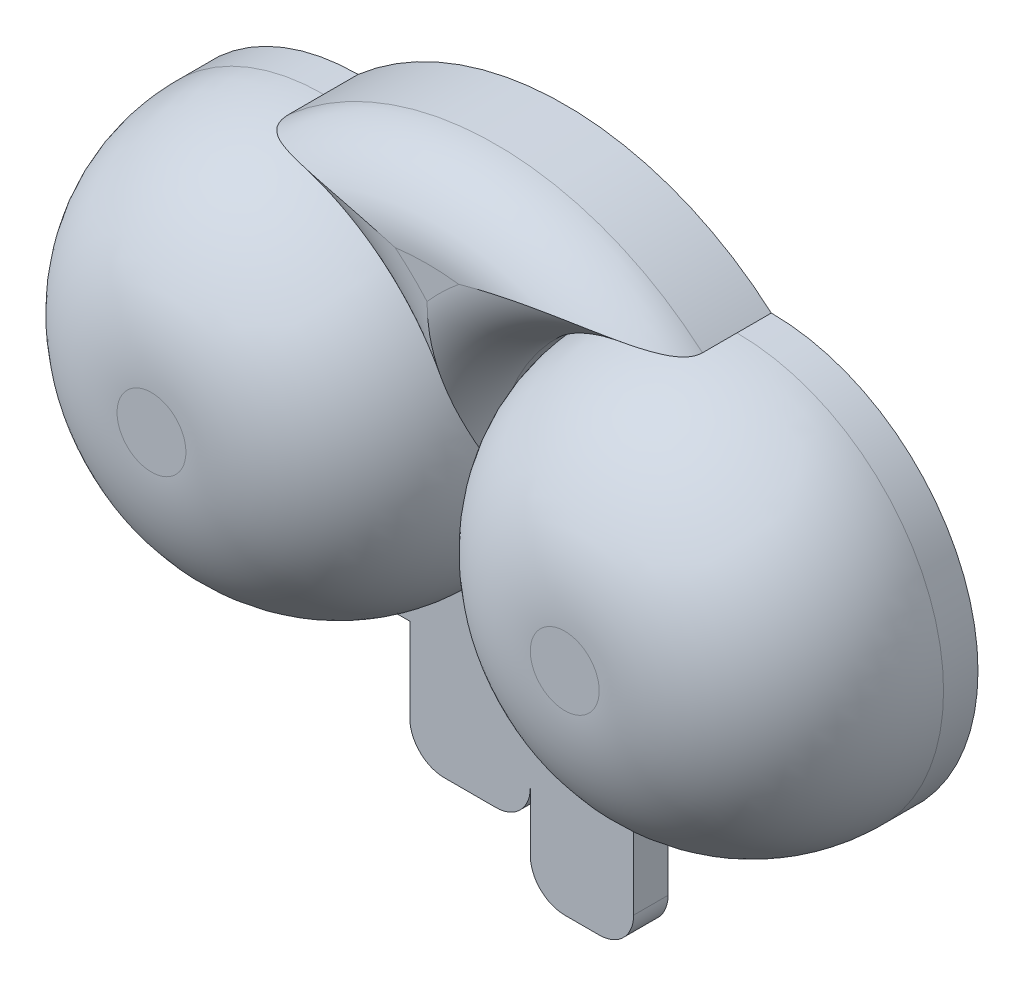
ISO-10303-21;
HEADER;
FILE_DESCRIPTION(('STEP AP214'),'2;1');
FILE_NAME('part.step','',(''),(''),'','','');
FILE_SCHEMA(('AUTOMOTIVE_DESIGN { 1 0 10303 214 1 1 1 1 }'));
ENDSEC;
DATA;
#1=APPLICATION_CONTEXT('core data for automotive mechanical design processes');
#2=APPLICATION_PROTOCOL_DEFINITION('international standard','automotive_design',2000,#1);
#3=PRODUCT_CONTEXT('',#1,'mechanical');
#4=PRODUCT('Part','Part','',(#3));
#5=PRODUCT_RELATED_PRODUCT_CATEGORY('part','',(#4));
#6=PRODUCT_DEFINITION_FORMATION('','',#4);
#7=PRODUCT_DEFINITION_CONTEXT('part definition',#1,'design');
#8=PRODUCT_DEFINITION('design','',#6,#7);
#9=PRODUCT_DEFINITION_SHAPE('','',#8);
#10=(LENGTH_UNIT() NAMED_UNIT(*) SI_UNIT(.MILLI.,.METRE.));
#11=(NAMED_UNIT(*) PLANE_ANGLE_UNIT() SI_UNIT($,.RADIAN.));
#12=(NAMED_UNIT(*) SI_UNIT($,.STERADIAN.) SOLID_ANGLE_UNIT());
#13=UNCERTAINTY_MEASURE_WITH_UNIT(LENGTH_MEASURE(1.E-05),#10,'distance_accuracy_value','');
#14=(GEOMETRIC_REPRESENTATION_CONTEXT(3) GLOBAL_UNCERTAINTY_ASSIGNED_CONTEXT((#13)) GLOBAL_UNIT_ASSIGNED_CONTEXT((#10,
#11,#12)) REPRESENTATION_CONTEXT('',''));
#15=CARTESIAN_POINT('',(0.,0.,0.));
#16=DIRECTION('',(0.,0.,1.));
#17=DIRECTION('',(1.,0.,0.));
#18=AXIS2_PLACEMENT_3D('',#15,#16,#17);
#19=CARTESIAN_POINT('',(0.,-6.,1.));
#20=DIRECTION('',(0.,-1.,0.));
#21=DIRECTION('',(1.,0.,0.));
#22=AXIS2_PLACEMENT_3D('',#19,#20,#21);
#23=PLANE('',#22);
#24=DIRECTION('',(-1.,0.,0.));
#25=VECTOR('',#24,1.);
#26=CARTESIAN_POINT('',(0.,-6.,1.));
#27=LINE('',#26,#25);
#28=CARTESIAN_POINT('',(12.,-6.00000000000001,1.));
#29=VERTEX_POINT('',#28);
#30=CARTESIAN_POINT('',(9.,-6.,1.));
#31=VERTEX_POINT('',#30);
#32=EDGE_CURVE('E280',#29,#31,#27,.T.);
#33=ORIENTED_EDGE('',*,*,#32,.T.);
#34=DIRECTION('',(0.,0.,1.));
#35=VECTOR('',#34,1.);
#36=CARTESIAN_POINT('',(9.,-6.,0.));
#37=LINE('',#36,#35);
#38=CARTESIAN_POINT('',(9.,-6.,0.));
#39=VERTEX_POINT('',#38);
#40=EDGE_CURVE('E75',#39,#31,#37,.T.);
#41=ORIENTED_EDGE('',*,*,#40,.F.);
#42=DIRECTION('',(-1.,0.,0.));
#43=VECTOR('',#42,1.);
#44=CARTESIAN_POINT('',(0.,-6.,0.));
#45=LINE('',#44,#43);
#46=CARTESIAN_POINT('',(12.,-6.,0.));
#47=VERTEX_POINT('',#46);
#48=EDGE_CURVE('E279',#47,#39,#45,.T.);
#49=ORIENTED_EDGE('',*,*,#48,.F.);
#50=DIRECTION('',(0.,0.,-1.));
#51=VECTOR('',#50,1.);
#52=CARTESIAN_POINT('',(12.,-6.,1.));
#53=LINE('',#52,#51);
#54=EDGE_CURVE('E288',#29,#47,#53,.T.);
#55=ORIENTED_EDGE('',*,*,#54,.F.);
#56=EDGE_LOOP('',(#33,#41,#49,#55));
#57=FACE_BOUND('',#56,.T.);
#58=ADVANCED_FACE('F45',(#57),#23,.T.);
#59=CARTESIAN_POINT('',(0.,0.,6.));
#60=DIRECTION('',(0.,0.,-1.));
#61=DIRECTION('',(-1.,0.,0.));
#62=AXIS2_PLACEMENT_3D('',#59,#60,#61);
#63=CYLINDRICAL_SURFACE('',#62,6.);
#64=DIRECTION('',(0.,0.,-1.));
#65=VECTOR('',#64,1.);
#66=CARTESIAN_POINT('',(0.,-6.,1.));
#67=LINE('',#66,#65);
#68=CARTESIAN_POINT('',(0.,-6.,1.));
#69=VERTEX_POINT('',#68);
#70=CARTESIAN_POINT('',(0.,-6.,0.));
#71=VERTEX_POINT('',#70);
#72=EDGE_CURVE('E285',#69,#71,#67,.T.);
#73=ORIENTED_EDGE('',*,*,#72,.F.);
#74=CARTESIAN_POINT('',(0.,0.,1.));
#75=DIRECTION('',(0.,0.,1.));
#76=DIRECTION('',(1.,0.,0.));
#77=AXIS2_PLACEMENT_3D('',#74,#75,#76);
#78=CIRCLE('',#77,6.);
#79=CARTESIAN_POINT('',(0.,6.,1.));
#80=VERTEX_POINT('',#79);
#81=EDGE_CURVE('E301',#69,#80,#78,.F.);
#82=ORIENTED_EDGE('',*,*,#81,.T.);
#83=DIRECTION('',(0.,0.,-1.));
#84=VECTOR('',#83,1.);
#85=CARTESIAN_POINT('',(0.,6.,1.));
#86=LINE('',#85,#84);
#87=CARTESIAN_POINT('',(0.,6.,0.));
#88=VERTEX_POINT('',#87);
#89=EDGE_CURVE('E282',#80,#88,#86,.T.);
#90=ORIENTED_EDGE('',*,*,#89,.T.);
#91=CARTESIAN_POINT('',(0.,0.,0.));
#92=DIRECTION('',(0.,0.,1.));
#93=DIRECTION('',(1.,0.,0.));
#94=AXIS2_PLACEMENT_3D('',#91,#92,#93);
#95=CIRCLE('',#94,6.);
#96=EDGE_CURVE('E287',#88,#71,#95,.T.);
#97=ORIENTED_EDGE('',*,*,#96,.T.);
#98=EDGE_LOOP('',(#73,#82,#90,#97));
#99=FACE_BOUND('',#98,.T.);
#100=ADVANCED_FACE('F346',(#99),#63,.T.);
#101=CARTESIAN_POINT('',(0.,0.,6.));
#102=DIRECTION('',(0.,0.,1.));
#103=DIRECTION('',(1.,0.,0.));
#104=AXIS2_PLACEMENT_3D('',#101,#102,#103);
#105=PLANE('',#104);
#106=CARTESIAN_POINT('',(0.,0.,6.));
#107=DIRECTION('',(0.,0.,1.));
#108=DIRECTION('',(1.,0.,0.));
#109=AXIS2_PLACEMENT_3D('',#106,#107,#108);
#110=CIRCLE('',#109,1.);
#111=CARTESIAN_POINT('',(1.,0.,6.));
#112=VERTEX_POINT('',#111);
#113=EDGE_CURVE('E297',#112,#112,#110,.T.);
#114=ORIENTED_EDGE('',*,*,#113,.T.);
#115=EDGE_LOOP('',(#114));
#116=FACE_BOUND('',#115,.T.);
#117=ADVANCED_FACE('F352',(#116),#105,.T.);
#118=CARTESIAN_POINT('',(0.,0.,0.));
#119=DIRECTION('',(0.,0.,1.));
#120=DIRECTION('',(1.,0.,0.));
#121=AXIS2_PLACEMENT_3D('',#118,#119,#120);
#122=PLANE('',#121);
#123=CARTESIAN_POINT('',(12.,0.,0.));
#124=DIRECTION('',(0.,0.,-1.));
#125=DIRECTION('',(-1.,0.,0.));
#126=AXIS2_PLACEMENT_3D('',#123,#124,#125);
#127=CIRCLE('',#126,6.);
#128=CARTESIAN_POINT('',(12.,6.00000000000001,0.));
#129=VERTEX_POINT('',#128);
#130=EDGE_CURVE('E274',#129,#47,#127,.T.);
#131=ORIENTED_EDGE('',*,*,#130,.T.);
#132=ORIENTED_EDGE('',*,*,#48,.T.);
#133=DIRECTION('',(0.,-1.,0.));
#134=VECTOR('',#133,1.);
#135=CARTESIAN_POINT('',(9.,0.,0.));
#136=LINE('',#135,#134);
#137=CARTESIAN_POINT('',(9.,-10.1423780859109,0.));
#138=VERTEX_POINT('',#137);
#139=EDGE_CURVE('E221',#39,#138,#136,.T.);
#140=ORIENTED_EDGE('',*,*,#139,.T.);
#141=CARTESIAN_POINT('',(8.,-10.142378085911,0.));
#142=DIRECTION('',(0.,0.,1.));
#143=DIRECTION('',(1.,0.,0.));
#144=AXIS2_PLACEMENT_3D('',#141,#142,#143);
#145=CIRCLE('',#144,0.999999999999999);
#146=CARTESIAN_POINT('',(7.99999999999999,-11.142378085911,0.));
#147=VERTEX_POINT('',#146);
#148=EDGE_CURVE('E219',#138,#147,#145,.F.);
#149=ORIENTED_EDGE('',*,*,#148,.T.);
#150=DIRECTION('',(1.,0.,0.));
#151=VECTOR('',#150,1.);
#152=CARTESIAN_POINT('',(0.,-11.142378085911,0.));
#153=LINE('',#152,#151);
#154=CARTESIAN_POINT('',(7.,-11.142378085911,0.));
#155=VERTEX_POINT('',#154);
#156=EDGE_CURVE('E216',#155,#147,#153,.T.);
#157=ORIENTED_EDGE('',*,*,#156,.F.);
#158=CARTESIAN_POINT('',(7.,-10.142378085911,0.));
#159=DIRECTION('',(0.,0.,1.));
#160=DIRECTION('',(1.,0.,0.));
#161=AXIS2_PLACEMENT_3D('',#158,#159,#160);
#162=CIRCLE('',#161,1.);
#163=CARTESIAN_POINT('',(6.,-10.1423780859109,0.));
#164=VERTEX_POINT('',#163);
#165=EDGE_CURVE('E213',#164,#155,#162,.T.);
#166=ORIENTED_EDGE('',*,*,#165,.F.);
#167=DIRECTION('',(0.,-1.,0.));
#168=VECTOR('',#167,1.);
#169=CARTESIAN_POINT('',(6.,0.,0.));
#170=LINE('',#169,#168);
#171=CARTESIAN_POINT('',(6.,-8.43567932679173,0.));
#172=VERTEX_POINT('',#171);
#173=EDGE_CURVE('E210',#172,#164,#170,.T.);
#174=ORIENTED_EDGE('',*,*,#173,.F.);
#175=CARTESIAN_POINT('',(5.,-8.43567932679174,0.));
#176=DIRECTION('',(0.,0.,1.));
#177=DIRECTION('',(1.,0.,0.));
#178=AXIS2_PLACEMENT_3D('',#175,#176,#177);
#179=CIRCLE('',#178,1.);
#180=CARTESIAN_POINT('',(4.99999999999999,-9.43567932679174,0.));
#181=VERTEX_POINT('',#180);
#182=EDGE_CURVE('E184',#172,#181,#179,.F.);
#183=ORIENTED_EDGE('',*,*,#182,.T.);
#184=DIRECTION('',(-1.,0.,0.));
#185=VECTOR('',#184,1.);
#186=CARTESIAN_POINT('',(0.,-9.43567932679174,0.));
#187=LINE('',#186,#185);
#188=CARTESIAN_POINT('',(3.5,-9.43567932679174,0.));
#189=VERTEX_POINT('',#188);
#190=EDGE_CURVE('E174',#181,#189,#187,.T.);
#191=ORIENTED_EDGE('',*,*,#190,.T.);
#192=CARTESIAN_POINT('',(3.5,-8.43567932679174,0.));
#193=DIRECTION('',(0.,0.,1.));
#194=DIRECTION('',(1.,0.,0.));
#195=AXIS2_PLACEMENT_3D('',#192,#193,#194);
#196=CIRCLE('',#195,1.);
#197=CARTESIAN_POINT('',(2.5,-8.43567932679174,0.));
#198=VERTEX_POINT('',#197);
#199=EDGE_CURVE('E180',#189,#198,#196,.F.);
#200=ORIENTED_EDGE('',*,*,#199,.T.);
#201=DIRECTION('',(0.,-1.,0.));
#202=VECTOR('',#201,1.);
#203=CARTESIAN_POINT('',(2.5,0.,0.));
#204=LINE('',#203,#202);
#205=CARTESIAN_POINT('',(2.5,-6.,0.));
#206=VERTEX_POINT('',#205);
#207=EDGE_CURVE('E198',#206,#198,#204,.T.);
#208=ORIENTED_EDGE('',*,*,#207,.F.);
#209=EDGE_CURVE('E67',#206,#71,#45,.T.);
#210=ORIENTED_EDGE('',*,*,#209,.T.);
#211=ORIENTED_EDGE('',*,*,#96,.F.);
#212=CARTESIAN_POINT('',(6.,-0.903698439468304,0.));
#213=DIRECTION('',(0.,0.,-1.));
#214=DIRECTION('',(-1.,0.,0.));
#215=AXIS2_PLACEMENT_3D('',#212,#213,#214);
#216=CIRCLE('',#215,9.14664157727399);
#217=EDGE_CURVE('E243',#88,#129,#216,.T.);
#218=ORIENTED_EDGE('',*,*,#217,.T.);
#219=EDGE_LOOP('',(#131,#132,#140,#149,#157,#166,#174,#183,#191,#200,#208,#210,#211,#218));
#220=FACE_BOUND('',#219,.T.);
#221=ADVANCED_FACE('F177',(#220),#122,.F.);
#222=CARTESIAN_POINT('',(0.,0.,1.));
#223=DIRECTION('',(0.,0.,1.));
#224=DIRECTION('',(1.,0.,0.));
#225=AXIS2_PLACEMENT_3D('',#222,#223,#224);
#226=DEGENERATE_TOROIDAL_SURFACE('',#225,1.,5.,.T.);
#227=ORIENTED_EDGE('',*,*,#81,.F.);
#228=CARTESIAN_POINT('',(6.,0.,1.));
#229=VERTEX_POINT('',#228);
#230=EDGE_CURVE('E300',#229,#69,#78,.F.);
#231=ORIENTED_EDGE('',*,*,#230,.F.);
#232=EDGE_CURVE('E305',#80,#229,#78,.F.);
#233=ORIENTED_EDGE('',*,*,#232,.F.);
#234=EDGE_LOOP('',(#227,#231,#233));
#235=FACE_BOUND('',#234,.T.);
#236=ORIENTED_EDGE('',*,*,#113,.F.);
#237=EDGE_LOOP('',(#236));
#238=FACE_BOUND('',#237,.T.);
#239=ADVANCED_FACE('F359',(#235,#238),#226,.T.);
#240=DIRECTION('',(0.,0.,1.));
#241=VECTOR('',#240,1.);
#242=CARTESIAN_POINT('',(2.5,-6.,0.));
#243=LINE('',#242,#241);
#244=CARTESIAN_POINT('',(2.5,-6.,1.));
#245=VERTEX_POINT('',#244);
#246=EDGE_CURVE('E244',#206,#245,#243,.T.);
#247=ORIENTED_EDGE('',*,*,#246,.T.);
#248=EDGE_CURVE('E278',#245,#69,#27,.T.);
#249=ORIENTED_EDGE('',*,*,#248,.T.);
#250=ORIENTED_EDGE('',*,*,#72,.T.);
#251=ORIENTED_EDGE('',*,*,#209,.F.);
#252=EDGE_LOOP('',(#247,#249,#250,#251));
#253=FACE_BOUND('',#252,.T.);
#254=ADVANCED_FACE('F348',(#253),#23,.T.);
#255=CARTESIAN_POINT('',(12.,0.,1.));
#256=DIRECTION('',(0.,0.,-1.));
#257=DIRECTION('',(-1.,0.,0.));
#258=AXIS2_PLACEMENT_3D('',#255,#256,#257);
#259=CYLINDRICAL_SURFACE('',#258,6.);
#260=ORIENTED_EDGE('',*,*,#130,.F.);
#261=DIRECTION('',(0.,0.,-1.));
#262=VECTOR('',#261,1.);
#263=CARTESIAN_POINT('',(12.,6.,1.));
#264=LINE('',#263,#262);
#265=CARTESIAN_POINT('',(12.,6.00000000000001,1.));
#266=VERTEX_POINT('',#265);
#267=EDGE_CURVE('E290',#266,#129,#264,.T.);
#268=ORIENTED_EDGE('',*,*,#267,.F.);
#269=CARTESIAN_POINT('',(12.,0.,1.));
#270=DIRECTION('',(0.,0.,-1.));
#271=DIRECTION('',(-1.,0.,0.));
#272=AXIS2_PLACEMENT_3D('',#269,#270,#271);
#273=CIRCLE('',#272,6.);
#274=EDGE_CURVE('E275',#266,#29,#273,.T.);
#275=ORIENTED_EDGE('',*,*,#274,.T.);
#276=ORIENTED_EDGE('',*,*,#54,.T.);
#277=EDGE_LOOP('',(#260,#268,#275,#276));
#278=FACE_BOUND('',#277,.T.);
#279=ADVANCED_FACE('F358',(#278),#259,.T.);
#280=CARTESIAN_POINT('',(0.,0.,1.));
#281=DIRECTION('',(0.,0.,-1.));
#282=DIRECTION('',(-1.,0.,0.));
#283=AXIS2_PLACEMENT_3D('',#280,#281,#282);
#284=PLANE('',#283);
#285=ORIENTED_EDGE('',*,*,#32,.F.);
#286=CARTESIAN_POINT('',(12.,0.,1.));
#287=DIRECTION('',(0.,0.,1.));
#288=DIRECTION('',(1.,0.,0.));
#289=AXIS2_PLACEMENT_3D('',#286,#287,#288);
#290=CIRCLE('',#289,6.00000000000001);
#291=EDGE_CURVE('E271',#29,#229,#290,.F.);
#292=ORIENTED_EDGE('',*,*,#291,.T.);
#293=ORIENTED_EDGE('',*,*,#230,.T.);
#294=ORIENTED_EDGE('',*,*,#248,.F.);
#295=DIRECTION('',(0.,-1.,0.));
#296=VECTOR('',#295,1.);
#297=CARTESIAN_POINT('',(2.5,0.,1.));
#298=LINE('',#297,#296);
#299=CARTESIAN_POINT('',(2.5,-8.43567932679174,1.));
#300=VERTEX_POINT('',#299);
#301=EDGE_CURVE('E203',#245,#300,#298,.T.);
#302=ORIENTED_EDGE('',*,*,#301,.T.);
#303=CARTESIAN_POINT('',(3.5,-8.43567932679174,1.));
#304=DIRECTION('',(0.,0.,1.));
#305=DIRECTION('',(1.,0.,0.));
#306=AXIS2_PLACEMENT_3D('',#303,#304,#305);
#307=CIRCLE('',#306,1.);
#308=CARTESIAN_POINT('',(3.5,-9.43567932679174,1.));
#309=VERTEX_POINT('',#308);
#310=EDGE_CURVE('E224',#309,#300,#307,.F.);
#311=ORIENTED_EDGE('',*,*,#310,.F.);
#312=DIRECTION('',(-1.,0.,0.));
#313=VECTOR('',#312,1.);
#314=CARTESIAN_POINT('',(0.,-9.43567932679174,1.));
#315=LINE('',#314,#313);
#316=CARTESIAN_POINT('',(4.99999999999999,-9.43567932679174,1.));
#317=VERTEX_POINT('',#316);
#318=EDGE_CURVE('E193',#317,#309,#315,.T.);
#319=ORIENTED_EDGE('',*,*,#318,.F.);
#320=CARTESIAN_POINT('',(5.,-8.43567932679174,1.));
#321=DIRECTION('',(0.,0.,1.));
#322=DIRECTION('',(1.,0.,0.));
#323=AXIS2_PLACEMENT_3D('',#320,#321,#322);
#324=CIRCLE('',#323,1.);
#325=CARTESIAN_POINT('',(6.,-8.43567932679173,1.));
#326=VERTEX_POINT('',#325);
#327=EDGE_CURVE('E227',#326,#317,#324,.F.);
#328=ORIENTED_EDGE('',*,*,#327,.F.);
#329=DIRECTION('',(0.,-1.,0.));
#330=VECTOR('',#329,1.);
#331=CARTESIAN_POINT('',(6.,0.,1.));
#332=LINE('',#331,#330);
#333=CARTESIAN_POINT('',(6.,-10.1423780859109,1.));
#334=VERTEX_POINT('',#333);
#335=EDGE_CURVE('E229',#326,#334,#332,.T.);
#336=ORIENTED_EDGE('',*,*,#335,.T.);
#337=CARTESIAN_POINT('',(7.,-10.142378085911,1.));
#338=DIRECTION('',(0.,0.,1.));
#339=DIRECTION('',(1.,0.,0.));
#340=AXIS2_PLACEMENT_3D('',#337,#338,#339);
#341=CIRCLE('',#340,1.);
#342=CARTESIAN_POINT('',(7.,-11.142378085911,1.));
#343=VERTEX_POINT('',#342);
#344=EDGE_CURVE('E232',#334,#343,#341,.T.);
#345=ORIENTED_EDGE('',*,*,#344,.T.);
#346=DIRECTION('',(1.,0.,0.));
#347=VECTOR('',#346,1.);
#348=CARTESIAN_POINT('',(0.,-11.142378085911,1.));
#349=LINE('',#348,#347);
#350=CARTESIAN_POINT('',(7.99999999999999,-11.142378085911,1.));
#351=VERTEX_POINT('',#350);
#352=EDGE_CURVE('E235',#343,#351,#349,.T.);
#353=ORIENTED_EDGE('',*,*,#352,.T.);
#354=CARTESIAN_POINT('',(8.,-10.142378085911,1.));
#355=DIRECTION('',(0.,0.,1.));
#356=DIRECTION('',(1.,0.,0.));
#357=AXIS2_PLACEMENT_3D('',#354,#355,#356);
#358=CIRCLE('',#357,0.999999999999999);
#359=CARTESIAN_POINT('',(9.,-10.1423780859109,1.));
#360=VERTEX_POINT('',#359);
#361=EDGE_CURVE('E238',#360,#351,#358,.F.);
#362=ORIENTED_EDGE('',*,*,#361,.F.);
#363=DIRECTION('',(0.,-1.,0.));
#364=VECTOR('',#363,1.);
#365=CARTESIAN_POINT('',(9.,0.,1.));
#366=LINE('',#365,#364);
#367=EDGE_CURVE('E206',#31,#360,#366,.T.);
#368=ORIENTED_EDGE('',*,*,#367,.F.);
#369=EDGE_LOOP('',(#285,#292,#293,#294,#302,#311,#319,#328,#336,#345,#353,#362,#368));
#370=FACE_BOUND('',#369,.T.);
#371=ADVANCED_FACE('F364',(#370),#284,.F.);
#372=CARTESIAN_POINT('',(0.,0.,6.));
#373=DIRECTION('',(0.,0.,1.));
#374=DIRECTION('',(1.,0.,0.));
#375=AXIS2_PLACEMENT_3D('',#372,#373,#374);
#376=PLANE('',#375);
#377=CARTESIAN_POINT('',(12.,0.,6.));
#378=DIRECTION('',(0.,0.,1.));
#379=DIRECTION('',(1.,0.,0.));
#380=AXIS2_PLACEMENT_3D('',#377,#378,#379);
#381=CIRCLE('',#380,1.00000000000001);
#382=CARTESIAN_POINT('',(13.,0.,6.));
#383=VERTEX_POINT('',#382);
#384=EDGE_CURVE('E268',#383,#383,#381,.T.);
#385=ORIENTED_EDGE('',*,*,#384,.T.);
#386=EDGE_LOOP('',(#385));
#387=FACE_BOUND('',#386,.T.);
#388=ADVANCED_FACE('F444',(#387),#376,.T.);
#389=CARTESIAN_POINT('',(12.,0.,1.));
#390=DIRECTION('',(0.,0.,1.));
#391=DIRECTION('',(1.,0.,0.));
#392=AXIS2_PLACEMENT_3D('',#389,#390,#391);
#393=DEGENERATE_TOROIDAL_SURFACE('',#392,1.00000000000001,5.,.T.);
#394=ORIENTED_EDGE('',*,*,#291,.F.);
#395=ORIENTED_EDGE('',*,*,#274,.F.);
#396=CARTESIAN_POINT('',(12.,0.,1.));
#397=DIRECTION('',(0.,0.,-1.));
#398=DIRECTION('',(-1.,0.,0.));
#399=AXIS2_PLACEMENT_3D('',#396,#397,#398);
#400=CIRCLE('',#399,6.00000000000001);
#401=EDGE_CURVE('E304',#229,#266,#400,.T.);
#402=ORIENTED_EDGE('',*,*,#401,.F.);
#403=EDGE_LOOP('',(#394,#395,#402));
#404=FACE_BOUND('',#403,.T.);
#405=ORIENTED_EDGE('',*,*,#384,.F.);
#406=EDGE_LOOP('',(#405));
#407=FACE_BOUND('',#406,.T.);
#408=ADVANCED_FACE('F442',(#404,#407),#393,.T.);
#409=CARTESIAN_POINT('',(0.,0.,4.));
#410=DIRECTION('',(0.,0.,-1.));
#411=DIRECTION('',(-1.,0.,0.));
#412=AXIS2_PLACEMENT_3D('',#409,#410,#411);
#413=CYLINDRICAL_SURFACE('',#412,6.);
#414=DIRECTION('',(0.,0.,-1.));
#415=VECTOR('',#414,1.);
#416=CARTESIAN_POINT('',(6.,0.,4.));
#417=LINE('',#416,#415);
#418=CARTESIAN_POINT('',(6.,0.,2.));
#419=VERTEX_POINT('',#418);
#420=EDGE_CURVE('E266',#419,#229,#417,.T.);
#421=ORIENTED_EDGE('',*,*,#420,.F.);
#422=CARTESIAN_POINT('',(0.,0.,2.));
#423=DIRECTION('',(0.,0.,1.));
#424=DIRECTION('',(1.,0.,0.));
#425=AXIS2_PLACEMENT_3D('',#422,#423,#424);
#426=CIRCLE('',#425,6.);
#427=CARTESIAN_POINT('',(0.,6.,2.));
#428=VERTEX_POINT('',#427);
#429=EDGE_CURVE('E12',#419,#428,#426,.T.);
#430=ORIENTED_EDGE('',*,*,#429,.T.);
#431=DIRECTION('',(0.,0.,-1.));
#432=VECTOR('',#431,1.);
#433=CARTESIAN_POINT('',(0.,6.,4.));
#434=LINE('',#433,#432);
#435=EDGE_CURVE('E261',#428,#80,#434,.T.);
#436=ORIENTED_EDGE('',*,*,#435,.T.);
#437=ORIENTED_EDGE('',*,*,#232,.T.);
#438=EDGE_LOOP('',(#421,#430,#436,#437));
#439=FACE_BOUND('',#438,.T.);
#440=ADVANCED_FACE('F438',(#439),#413,.F.);
#441=CARTESIAN_POINT('',(12.,0.,4.));
#442=DIRECTION('',(0.,0.,-1.));
#443=DIRECTION('',(-1.,0.,0.));
#444=AXIS2_PLACEMENT_3D('',#441,#442,#443);
#445=CYLINDRICAL_SURFACE('',#444,6.);
#446=DIRECTION('',(0.,0.,-1.));
#447=VECTOR('',#446,1.);
#448=CARTESIAN_POINT('',(12.,6.00000000000001,4.));
#449=LINE('',#448,#447);
#450=CARTESIAN_POINT('',(12.,6.00000000000001,2.));
#451=VERTEX_POINT('',#450);
#452=EDGE_CURVE('E264',#451,#266,#449,.T.);
#453=ORIENTED_EDGE('',*,*,#452,.F.);
#454=CARTESIAN_POINT('',(12.,0.,2.));
#455=DIRECTION('',(0.,0.,1.));
#456=DIRECTION('',(1.,0.,0.));
#457=AXIS2_PLACEMENT_3D('',#454,#455,#456);
#458=CIRCLE('',#457,6.);
#459=EDGE_CURVE('E59',#451,#419,#458,.T.);
#460=ORIENTED_EDGE('',*,*,#459,.T.);
#461=ORIENTED_EDGE('',*,*,#420,.T.);
#462=ORIENTED_EDGE('',*,*,#401,.T.);
#463=EDGE_LOOP('',(#453,#460,#461,#462));
#464=FACE_BOUND('',#463,.T.);
#465=ADVANCED_FACE('F435',(#464),#445,.F.);
#466=CARTESIAN_POINT('',(6.,-0.903698439468304,4.));
#467=DIRECTION('',(0.,0.,-1.));
#468=DIRECTION('',(-1.,0.,0.));
#469=AXIS2_PLACEMENT_3D('',#466,#467,#468);
#470=CYLINDRICAL_SURFACE('',#469,9.14664157727399);
#471=ORIENTED_EDGE('',*,*,#435,.F.);
#472=CARTESIAN_POINT('',(6.,-0.903698439468304,2.));
#473=DIRECTION('',(0.,0.,1.));
#474=DIRECTION('',(1.,0.,0.));
#475=AXIS2_PLACEMENT_3D('',#472,#473,#474);
#476=CIRCLE('',#475,9.14664157727399);
#477=EDGE_CURVE('E315',#428,#451,#476,.F.);
#478=ORIENTED_EDGE('',*,*,#477,.T.);
#479=ORIENTED_EDGE('',*,*,#452,.T.);
#480=ORIENTED_EDGE('',*,*,#267,.T.);
#481=ORIENTED_EDGE('',*,*,#217,.F.);
#482=ORIENTED_EDGE('',*,*,#89,.F.);
#483=EDGE_LOOP('',(#471,#478,#479,#480,#481,#482));
#484=FACE_BOUND('',#483,.T.);
#485=ADVANCED_FACE('F384',(#484),#470,.T.);
#486=CARTESIAN_POINT('',(3.,-0.451849219734152,4.));
#487=DIRECTION('',(0.,0.,1.));
#488=DIRECTION('',(1.,0.,0.));
#489=AXIS2_PLACEMENT_3D('',#486,#487,#488);
#490=PLANE('',#489);
#491=CARTESIAN_POINT('',(12.,0.,4.));
#492=DIRECTION('',(0.,0.,1.));
#493=DIRECTION('',(1.,0.,0.));
#494=AXIS2_PLACEMENT_3D('',#491,#492,#493);
#495=CIRCLE('',#494,8.);
#496=CARTESIAN_POINT('',(6.,5.29150262212918,4.));
#497=VERTEX_POINT('',#496);
#498=CARTESIAN_POINT('',(6.92355413393336,6.1830168501222,4.));
#499=VERTEX_POINT('',#498);
#500=EDGE_CURVE('E310',#497,#499,#495,.F.);
#501=ORIENTED_EDGE('',*,*,#500,.T.);
#502=CARTESIAN_POINT('',(6.,-0.903698439468304,4.));
#503=DIRECTION('',(0.,0.,1.));
#504=DIRECTION('',(1.,0.,0.));
#505=AXIS2_PLACEMENT_3D('',#502,#503,#504);
#506=CIRCLE('',#505,7.14664157727399);
#507=CARTESIAN_POINT('',(5.07644586606663,6.1830168501222,4.));
#508=VERTEX_POINT('',#507);
#509=EDGE_CURVE('E312',#499,#508,#506,.T.);
#510=ORIENTED_EDGE('',*,*,#509,.T.);
#511=CARTESIAN_POINT('',(0.,0.,4.));
#512=DIRECTION('',(0.,0.,1.));
#513=DIRECTION('',(1.,0.,0.));
#514=AXIS2_PLACEMENT_3D('',#511,#512,#513);
#515=CIRCLE('',#514,8.);
#516=EDGE_CURVE('E308',#508,#497,#515,.F.);
#517=ORIENTED_EDGE('',*,*,#516,.T.);
#518=EDGE_LOOP('',(#501,#510,#517));
#519=FACE_BOUND('',#518,.T.);
#520=ADVANCED_FACE('F342',(#519),#490,.T.);
#521=CARTESIAN_POINT('',(12.,0.,2.));
#522=DIRECTION('',(0.,0.,1.));
#523=DIRECTION('',(1.,0.,0.));
#524=AXIS2_PLACEMENT_3D('',#521,#522,#523);
#525=TOROIDAL_SURFACE('',#524,8.,2.);
#526=CARTESIAN_POINT('',(12.,6.00000000000001,2.));
#527=CARTESIAN_POINT('',(12.0000082231644,5.99999608413132,2.02263728121254));
#528=CARTESIAN_POINT('',(11.9989711243951,6.00038467534938,2.04526011227267));
#529=CARTESIAN_POINT('',(11.9948857156494,6.00191030103207,2.09026523800568));
#530=CARTESIAN_POINT('',(11.9918403843786,6.00304622700851,2.1126478391057));
#531=CARTESIAN_POINT('',(11.9799234453791,6.00747845959456,2.17857019658377));
#532=CARTESIAN_POINT('',(11.9682657638694,6.01180150994452,2.22155609254376));
#533=CARTESIAN_POINT('',(11.9347424803307,6.0240880077044,2.31608003627164));
#534=CARTESIAN_POINT('',(11.9109828184054,6.03271512462416,2.36683849807338));
#535=CARTESIAN_POINT('',(11.8560270517271,6.05226285095441,2.46393338925944));
#536=CARTESIAN_POINT('',(11.8247858477804,6.06319731978742,2.51024051695957));
#537=CARTESIAN_POINT('',(11.7615813340586,6.08478565102683,2.59256629585944));
#538=CARTESIAN_POINT('',(11.7302647531208,6.09528397772855,2.62913462099175));
#539=CARTESIAN_POINT('',(11.6646287762597,6.11678053049972,2.69933221293293));
#540=CARTESIAN_POINT('',(11.6303070191717,6.12777914632627,2.73295912645231));
#541=CARTESIAN_POINT('',(11.5238408865599,6.16102655459622,2.83002084537954));
#542=CARTESIAN_POINT('',(11.4482434110912,6.18351025604446,2.88957862062196));
#543=CARTESIAN_POINT('',(11.2870617168492,6.2286172751903,3.00361770679722));
#544=CARTESIAN_POINT('',(11.201159776735,6.25118393478892,3.05765810205241));
#545=CARTESIAN_POINT('',(11.0247685992202,6.2942173514798,3.1587695772759));
#546=CARTESIAN_POINT('',(10.9342748294098,6.31468197103294,3.20583358416731));
#547=CARTESIAN_POINT('',(10.7498155958095,6.3529228443989,3.29424482321373));
#548=CARTESIAN_POINT('',(10.6558443674757,6.3706943604413,3.33558196983368));
#549=CARTESIAN_POINT('',(10.4653412035967,6.40313489825223,3.41330391051955));
#550=CARTESIAN_POINT('',(10.3688085336231,6.41780301914277,3.44968726547023));
#551=CARTESIAN_POINT('',(10.1088892854852,6.45240639697328,3.54087016706435));
#552=CARTESIAN_POINT('',(9.94374021525993,6.46935625550001,3.59182383361529));
#553=CARTESIAN_POINT('',(9.60986772706055,6.49315798292491,3.68353499384332));
#554=CARTESIAN_POINT('',(9.44114214613969,6.50000355351424,3.72428611483605));
#555=CARTESIAN_POINT('',(9.10178764996161,6.50316364232466,3.79665119144417));
#556=CARTESIAN_POINT('',(8.93116031618013,6.4994863425404,3.82827222505302));
#557=CARTESIAN_POINT('',(8.58912992686684,6.48139224800761,3.88316097217551));
#558=CARTESIAN_POINT('',(8.41772677953578,6.46697414747173,3.90642766952084));
#559=CARTESIAN_POINT('',(8.02541016108659,6.42153075773248,3.95075167275324));
#560=CARTESIAN_POINT('',(7.80461178718557,6.38689240689977,3.96919328794657));
#561=CARTESIAN_POINT('',(7.36620851929872,6.29969409933361,3.99371288564532));
#562=CARTESIAN_POINT('',(7.14859901403396,6.24716339251857,3.99981093480921));
#563=CARTESIAN_POINT('',(6.9302680619372,6.1849373201739,3.99999855625776));
#564=CARTESIAN_POINT('',(6.92691077396444,6.18397815075352,3.99999999907521));
#565=CARTESIAN_POINT('',(6.92355413393336,6.1830168501222,4.));
#566=B_SPLINE_CURVE_WITH_KNOTS('',3,(#526,#527,#528,#529,#530,#531,#532,#533,#534,#535,#536,
#537,#538,#539,#540,#541,#542,#543,#544,#545,#546,#547,#548,#549,#550,#551,#552,#553,#554,#555,
#556,#557,#558,#559,#560,#561,#562,#563,#564,#565),.UNSPECIFIED.,.F.,.F.,(4,2,2,2,2,2,2,2,2,2,2,
2,2,2,2,2,2,2,2,4),(0.,0.0678586814558316,0.135616937403088,0.26915091334482,0.438325374310288,
0.608546503864981,0.756164752814016,0.903900044331028,1.19959917070016,1.51108862819305,
1.82289176334975,2.13523721623602,2.44767321519433,2.96791061271773,3.4884721532318,
4.00862904425352,4.52884918243601,5.20053628223674,5.87113055556514,5.8816054024103),.UNSPECIFIED.);
#567=EDGE_CURVE('E324',#499,#451,#566,.F.);
#568=ORIENTED_EDGE('',*,*,#567,.F.);
#569=ORIENTED_EDGE('',*,*,#500,.F.);
#570=CARTESIAN_POINT('',(6.,0.,2.));
#571=CARTESIAN_POINT('',(6.,0.00316227364336107,2.00182573612724));
#572=CARTESIAN_POINT('',(6.,0.0063245513299962,2.00365147806106));
#573=CARTESIAN_POINT('',(6.00000000000003,0.410742672052066,2.23714195019465));
#574=CARTESIAN_POINT('',(6.00000000000001,0.81210969985987,2.46881467297365));
#575=CARTESIAN_POINT('',(5.99999999999999,1.42346113588428,2.80025890638982));
#576=CARTESIAN_POINT('',(6.,1.62898098084235,2.90815113063967));
#577=CARTESIAN_POINT('',(6.,2.04425236927216,3.11540766013306));
#578=CARTESIAN_POINT('',(6.,2.25400256402637,3.21477463192488));
#579=CARTESIAN_POINT('',(6.,2.64907834539796,3.38848261704156));
#580=CARTESIAN_POINT('',(6.,2.83371336228979,3.46437976059994));
#581=CARTESIAN_POINT('',(6.,3.20739366449962,3.6048161270656));
#582=CARTESIAN_POINT('',(6.,3.39644053904433,3.66935118333718));
#583=CARTESIAN_POINT('',(6.,3.77806878848653,3.78382031080555));
#584=CARTESIAN_POINT('',(6.,3.97063128507987,3.83381647437731));
#585=CARTESIAN_POINT('',(6.,4.35942545832536,3.91611314259449));
#586=CARTESIAN_POINT('',(6.,4.55565234025482,3.9484352961269));
#587=CARTESIAN_POINT('',(6.,4.84094270268909,3.97950459109546));
#588=CARTESIAN_POINT('',(6.,4.92909926907175,3.98693107694071));
#589=CARTESIAN_POINT('',(6.,5.10568256612385,3.99708702970706));
#590=CARTESIAN_POINT('',(6.,5.19410921636532,3.99981777987782));
#591=CARTESIAN_POINT('',(6.,5.28551626838825,3.99999705990988));
#592=CARTESIAN_POINT('',(6.,5.2885094556956,3.99999999955906));
#593=CARTESIAN_POINT('',(6.,5.29150262212918,4.));
#594=B_SPLINE_CURVE_WITH_KNOTS('',3,(#570,#571,#572,#573,#574,#575,#576,#577,#578,#579,#580,
#581,#582,#583,#584,#585,#586,#587,#588,#589,#590,#591,#592,#593),.UNSPECIFIED.,.F.,.F.,(4,2,2,
2,2,2,2,2,2,2,2,4),(0.,0.0109544511562698,1.40094239473863,2.09716891063497,2.79317685918102,
3.39176579249262,3.99057378155034,4.58678551740403,5.18226530843188,5.44757801911853,
5.71281821367354,5.721797773715),.UNSPECIFIED.);
#595=EDGE_CURVE('E50',#419,#497,#594,.T.);
#596=ORIENTED_EDGE('',*,*,#595,.F.);
#597=ORIENTED_EDGE('',*,*,#459,.F.);
#598=EDGE_LOOP('',(#568,#569,#596,#597));
#599=FACE_BOUND('',#598,.T.);
#600=ADVANCED_FACE('F47',(#599),#525,.T.);
#601=CARTESIAN_POINT('',(0.,0.,2.));
#602=DIRECTION('',(0.,0.,1.));
#603=DIRECTION('',(1.,0.,0.));
#604=AXIS2_PLACEMENT_3D('',#601,#602,#603);
#605=TOROIDAL_SURFACE('',#604,8.,2.);
#606=ORIENTED_EDGE('',*,*,#595,.T.);
#607=ORIENTED_EDGE('',*,*,#516,.F.);
#608=CARTESIAN_POINT('',(0.,6.,2.));
#609=CARTESIAN_POINT('',(-8.22316440654374E-06,5.99999608413132,2.02263728121254));
#610=CARTESIAN_POINT('',(0.00102887560485272,6.00038467534937,2.04526011227267));
#611=CARTESIAN_POINT('',(0.00511428435064748,6.00191030103206,2.09026523800568));
#612=CARTESIAN_POINT('',(0.00815961562144411,6.0030462270085,2.11264783910571));
#613=CARTESIAN_POINT('',(0.0200765546209304,6.00747845959456,2.17857019658377));
#614=CARTESIAN_POINT('',(0.0317342361306556,6.01180150994451,2.22155609254376));
#615=CARTESIAN_POINT('',(0.0652575196692928,6.0240880077044,2.31608003627164));
#616=CARTESIAN_POINT('',(0.0890171815946415,6.03271512462415,2.36683849807338));
#617=CARTESIAN_POINT('',(0.143972948272929,6.05226285095441,2.46393338925944));
#618=CARTESIAN_POINT('',(0.17521415221962,6.06319731978741,2.51024051695957));
#619=CARTESIAN_POINT('',(0.238418665941366,6.08478565102682,2.59256629585944));
#620=CARTESIAN_POINT('',(0.269735246879226,6.09528397772854,2.62913462099176));
#621=CARTESIAN_POINT('',(0.335371223740325,6.11678053049971,2.69933221293293));
#622=CARTESIAN_POINT('',(0.369692980828279,6.12777914632626,2.73295912645231));
#623=CARTESIAN_POINT('',(0.476159113440096,6.16102655459622,2.83002084537954));
#624=CARTESIAN_POINT('',(0.551756588908767,6.18351025604446,2.88957862062196));
#625=CARTESIAN_POINT('',(0.71293828315077,6.22861727519029,3.00361770679722));
#626=CARTESIAN_POINT('',(0.798840223265034,6.25118393478892,3.0576581020524));
#627=CARTESIAN_POINT('',(0.975231400779846,6.29421735147979,3.1587695772759));
#628=CARTESIAN_POINT('',(1.06572517059024,6.31468197103293,3.20583358416731));
#629=CARTESIAN_POINT('',(1.2501844041905,6.3529228443989,3.29424482321373));
#630=CARTESIAN_POINT('',(1.34415563252435,6.3706943604413,3.33558196983368));
#631=CARTESIAN_POINT('',(1.53465879640332,6.40313489825223,3.41330391051955));
#632=CARTESIAN_POINT('',(1.63119146637688,6.41780301914276,3.44968726547023));
#633=CARTESIAN_POINT('',(1.89111071451484,6.45240639697328,3.54087016706435));
#634=CARTESIAN_POINT('',(2.0562597847401,6.46935625550001,3.5918238336153));
#635=CARTESIAN_POINT('',(2.39013227293951,6.49315798292491,3.68353499384334));
#636=CARTESIAN_POINT('',(2.55885785386038,6.50000355351424,3.72428611483607));
#637=CARTESIAN_POINT('',(2.89821235003845,6.50316364232466,3.79665119144419));
#638=CARTESIAN_POINT('',(3.06883968381992,6.4994863425404,3.82827222505303));
#639=CARTESIAN_POINT('',(3.41087007313318,6.48139224800759,3.88316097217552));
#640=CARTESIAN_POINT('',(3.58227322046422,6.4669741474717,3.90642766952084));
#641=CARTESIAN_POINT('',(3.9745898389134,6.42153075773252,3.95075167275324));
#642=CARTESIAN_POINT('',(4.19538821281444,6.38689240689993,3.96919328794657));
#643=CARTESIAN_POINT('',(4.63379148070119,6.29969409933346,3.99371288564532));
#644=CARTESIAN_POINT('',(4.85140098596584,6.24716339251797,3.99981093480921));
#645=CARTESIAN_POINT('',(5.06973193806278,6.18493732017388,3.99999855625776));
#646=CARTESIAN_POINT('',(5.07308922603554,6.18397815075351,3.99999999907521));
#647=CARTESIAN_POINT('',(5.07644586606663,6.1830168501222,4.));
#648=B_SPLINE_CURVE_WITH_KNOTS('',3,(#608,#609,#610,#611,#612,#613,#614,#615,#616,#617,#618,
#619,#620,#621,#622,#623,#624,#625,#626,#627,#628,#629,#630,#631,#632,#633,#634,#635,#636,#637,
#638,#639,#640,#641,#642,#643,#644,#645,#646,#647),.UNSPECIFIED.,.F.,.F.,(4,2,2,2,2,2,2,2,2,2,2,
2,2,2,2,2,2,2,2,4),(0.,0.0678586814558325,0.135616937403088,0.269150913344822,0.438325374310288,
0.608546503864979,0.756164752814016,0.903900044331029,1.19959917070016,1.51108862819305,
1.82289176334975,2.13523721623602,2.44767321519433,2.96791061271778,3.48847215323188,
4.00862904425355,4.52884918243601,5.20053628223669,5.87113055556512,5.88160540241029),.UNSPECIFIED.);
#649=EDGE_CURVE('E260',#428,#508,#648,.T.);
#650=ORIENTED_EDGE('',*,*,#649,.F.);
#651=ORIENTED_EDGE('',*,*,#429,.F.);
#652=EDGE_LOOP('',(#606,#607,#650,#651));
#653=FACE_BOUND('',#652,.T.);
#654=ADVANCED_FACE('F332',(#653),#605,.T.);
#655=CARTESIAN_POINT('',(6.,-0.903698439468304,2.));
#656=DIRECTION('',(0.,0.,1.));
#657=DIRECTION('',(1.,0.,0.));
#658=AXIS2_PLACEMENT_3D('',#655,#656,#657);
#659=TOROIDAL_SURFACE('',#658,7.14664157727399,2.);
#660=ORIENTED_EDGE('',*,*,#567,.T.);
#661=ORIENTED_EDGE('',*,*,#477,.F.);
#662=ORIENTED_EDGE('',*,*,#649,.T.);
#663=ORIENTED_EDGE('',*,*,#509,.F.);
#664=EDGE_LOOP('',(#660,#661,#662,#663));
#665=FACE_BOUND('',#664,.T.);
#666=ADVANCED_FACE('F329',(#665),#659,.T.);
#667=CARTESIAN_POINT('',(3.5,-8.43567932679174,0.));
#668=DIRECTION('',(0.,0.,1.));
#669=DIRECTION('',(1.,0.,0.));
#670=AXIS2_PLACEMENT_3D('',#667,#668,#669);
#671=CYLINDRICAL_SURFACE('',#670,1.);
#672=ORIENTED_EDGE('',*,*,#310,.T.);
#673=DIRECTION('',(0.,0.,1.));
#674=VECTOR('',#673,1.);
#675=CARTESIAN_POINT('',(2.5,-8.43567932679174,0.));
#676=LINE('',#675,#674);
#677=EDGE_CURVE('E201',#198,#300,#676,.T.);
#678=ORIENTED_EDGE('',*,*,#677,.F.);
#679=ORIENTED_EDGE('',*,*,#199,.F.);
#680=DIRECTION('',(0.,0.,1.));
#681=VECTOR('',#680,1.);
#682=CARTESIAN_POINT('',(3.5,-9.43567932679174,0.));
#683=LINE('',#682,#681);
#684=EDGE_CURVE('E190',#189,#309,#683,.T.);
#685=ORIENTED_EDGE('',*,*,#684,.T.);
#686=EDGE_LOOP('',(#672,#678,#679,#685));
#687=FACE_BOUND('',#686,.T.);
#688=ADVANCED_FACE('F200',(#687),#671,.T.);
#689=CARTESIAN_POINT('',(2.5,0.,0.));
#690=DIRECTION('',(-1.,0.,0.));
#691=DIRECTION('',(0.,-1.,0.));
#692=AXIS2_PLACEMENT_3D('',#689,#690,#691);
#693=PLANE('',#692);
#694=ORIENTED_EDGE('',*,*,#301,.F.);
#695=ORIENTED_EDGE('',*,*,#246,.F.);
#696=ORIENTED_EDGE('',*,*,#207,.T.);
#697=ORIENTED_EDGE('',*,*,#677,.T.);
#698=EDGE_LOOP('',(#694,#695,#696,#697));
#699=FACE_BOUND('',#698,.T.);
#700=ADVANCED_FACE('F370',(#699),#693,.T.);
#701=CARTESIAN_POINT('',(9.,0.,0.));
#702=DIRECTION('',(-1.,0.,0.));
#703=DIRECTION('',(0.,-1.,0.));
#704=AXIS2_PLACEMENT_3D('',#701,#702,#703);
#705=PLANE('',#704);
#706=ORIENTED_EDGE('',*,*,#367,.T.);
#707=DIRECTION('',(0.,0.,1.));
#708=VECTOR('',#707,1.);
#709=CARTESIAN_POINT('',(9.,-10.1423780859109,0.));
#710=LINE('',#709,#708);
#711=EDGE_CURVE('E247',#138,#360,#710,.T.);
#712=ORIENTED_EDGE('',*,*,#711,.F.);
#713=ORIENTED_EDGE('',*,*,#139,.F.);
#714=ORIENTED_EDGE('',*,*,#40,.T.);
#715=EDGE_LOOP('',(#706,#712,#713,#714));
#716=FACE_BOUND('',#715,.T.);
#717=ADVANCED_FACE('F391',(#716),#705,.F.);
#718=CARTESIAN_POINT('',(8.,-10.142378085911,0.));
#719=DIRECTION('',(0.,0.,1.));
#720=DIRECTION('',(1.,0.,0.));
#721=AXIS2_PLACEMENT_3D('',#718,#719,#720);
#722=CYLINDRICAL_SURFACE('',#721,0.999999999999999);
#723=ORIENTED_EDGE('',*,*,#361,.T.);
#724=DIRECTION('',(0.,0.,1.));
#725=VECTOR('',#724,1.);
#726=CARTESIAN_POINT('',(7.99999999999999,-11.142378085911,0.));
#727=LINE('',#726,#725);
#728=EDGE_CURVE('E250',#147,#351,#727,.T.);
#729=ORIENTED_EDGE('',*,*,#728,.F.);
#730=ORIENTED_EDGE('',*,*,#148,.F.);
#731=ORIENTED_EDGE('',*,*,#711,.T.);
#732=EDGE_LOOP('',(#723,#729,#730,#731));
#733=FACE_BOUND('',#732,.T.);
#734=ADVANCED_FACE('F397',(#733),#722,.T.);
#735=CARTESIAN_POINT('',(0.,-11.142378085911,0.));
#736=DIRECTION('',(0.,-1.,0.));
#737=DIRECTION('',(0.,0.,-1.));
#738=AXIS2_PLACEMENT_3D('',#735,#736,#737);
#739=PLANE('',#738);
#740=ORIENTED_EDGE('',*,*,#352,.F.);
#741=DIRECTION('',(0.,0.,1.));
#742=VECTOR('',#741,1.);
#743=CARTESIAN_POINT('',(7.,-11.142378085911,0.));
#744=LINE('',#743,#742);
#745=EDGE_CURVE('E252',#155,#343,#744,.T.);
#746=ORIENTED_EDGE('',*,*,#745,.F.);
#747=ORIENTED_EDGE('',*,*,#156,.T.);
#748=ORIENTED_EDGE('',*,*,#728,.T.);
#749=EDGE_LOOP('',(#740,#746,#747,#748));
#750=FACE_BOUND('',#749,.T.);
#751=ADVANCED_FACE('F411',(#750),#739,.T.);
#752=CARTESIAN_POINT('',(7.,-10.142378085911,0.));
#753=DIRECTION('',(0.,0.,1.));
#754=DIRECTION('',(1.,0.,0.));
#755=AXIS2_PLACEMENT_3D('',#752,#753,#754);
#756=CYLINDRICAL_SURFACE('',#755,1.);
#757=ORIENTED_EDGE('',*,*,#344,.F.);
#758=DIRECTION('',(0.,0.,1.));
#759=VECTOR('',#758,1.);
#760=CARTESIAN_POINT('',(6.,-10.1423780859109,0.));
#761=LINE('',#760,#759);
#762=EDGE_CURVE('E254',#164,#334,#761,.T.);
#763=ORIENTED_EDGE('',*,*,#762,.F.);
#764=ORIENTED_EDGE('',*,*,#165,.T.);
#765=ORIENTED_EDGE('',*,*,#745,.T.);
#766=EDGE_LOOP('',(#757,#763,#764,#765));
#767=FACE_BOUND('',#766,.T.);
#768=ADVANCED_FACE('F403',(#767),#756,.T.);
#769=CARTESIAN_POINT('',(6.,0.,0.));
#770=DIRECTION('',(-1.,0.,0.));
#771=DIRECTION('',(0.,0.,1.));
#772=AXIS2_PLACEMENT_3D('',#769,#770,#771);
#773=PLANE('',#772);
#774=ORIENTED_EDGE('',*,*,#335,.F.);
#775=DIRECTION('',(0.,0.,1.));
#776=VECTOR('',#775,1.);
#777=CARTESIAN_POINT('',(6.,-8.43567932679173,0.));
#778=LINE('',#777,#776);
#779=EDGE_CURVE('E256',#172,#326,#778,.T.);
#780=ORIENTED_EDGE('',*,*,#779,.F.);
#781=ORIENTED_EDGE('',*,*,#173,.T.);
#782=ORIENTED_EDGE('',*,*,#762,.T.);
#783=EDGE_LOOP('',(#774,#780,#781,#782));
#784=FACE_BOUND('',#783,.T.);
#785=ADVANCED_FACE('F407',(#784),#773,.T.);
#786=CARTESIAN_POINT('',(5.,-8.43567932679174,0.));
#787=DIRECTION('',(0.,0.,1.));
#788=DIRECTION('',(1.,0.,0.));
#789=AXIS2_PLACEMENT_3D('',#786,#787,#788);
#790=CYLINDRICAL_SURFACE('',#789,1.);
#791=ORIENTED_EDGE('',*,*,#327,.T.);
#792=DIRECTION('',(0.,0.,1.));
#793=VECTOR('',#792,1.);
#794=CARTESIAN_POINT('',(4.99999999999999,-9.43567932679174,0.));
#795=LINE('',#794,#793);
#796=EDGE_CURVE('E197',#181,#317,#795,.T.);
#797=ORIENTED_EDGE('',*,*,#796,.F.);
#798=ORIENTED_EDGE('',*,*,#182,.F.);
#799=ORIENTED_EDGE('',*,*,#779,.T.);
#800=EDGE_LOOP('',(#791,#797,#798,#799));
#801=FACE_BOUND('',#800,.T.);
#802=ADVANCED_FACE('F410',(#801),#790,.T.);
#803=CARTESIAN_POINT('',(0.,-9.43567932679174,0.));
#804=DIRECTION('',(0.,1.,0.));
#805=DIRECTION('',(0.,0.,1.));
#806=AXIS2_PLACEMENT_3D('',#803,#804,#805);
#807=PLANE('',#806);
#808=ORIENTED_EDGE('',*,*,#318,.T.);
#809=ORIENTED_EDGE('',*,*,#684,.F.);
#810=ORIENTED_EDGE('',*,*,#190,.F.);
#811=ORIENTED_EDGE('',*,*,#796,.T.);
#812=EDGE_LOOP('',(#808,#809,#810,#811));
#813=FACE_BOUND('',#812,.T.);
#814=ADVANCED_FACE('F191',(#813),#807,.F.);
#815=CLOSED_SHELL('',(#58,#100,#117,#221,#239,#254,#279,#371,#388,#408,#440,#465,#485,#520,#600,
#654,#666,#688,#700,#717,#734,#751,#768,#785,#802,#814));
#816=MANIFOLD_SOLID_BREP('B2',#815);
#817=ADVANCED_BREP_SHAPE_REPRESENTATION('',(#18,#816),#14);
#818=SHAPE_DEFINITION_REPRESENTATION(#9,#817);
ENDSEC;
END-ISO-10303-21;
